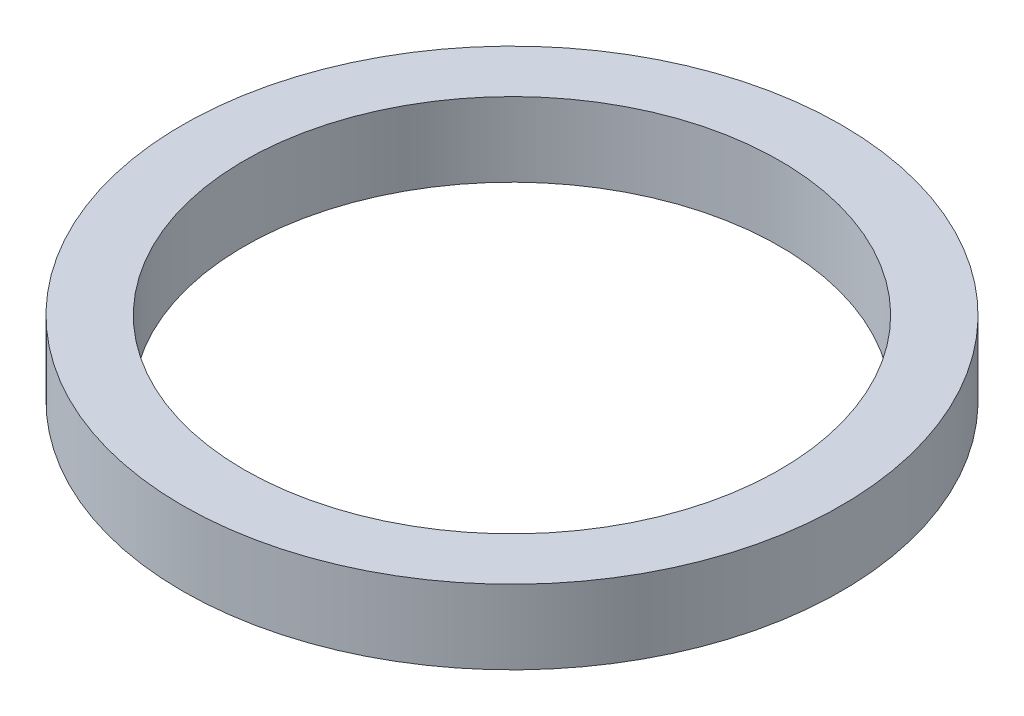
ISO-10303-21;
HEADER;
FILE_DESCRIPTION(('STEP AP214'),'2;1');
FILE_NAME('part.step','',(''),(''),'','','');
FILE_SCHEMA(('AUTOMOTIVE_DESIGN { 1 0 10303 214 1 1 1 1 }'));
ENDSEC;
DATA;
#1=APPLICATION_CONTEXT('core data for automotive mechanical design processes');
#2=APPLICATION_PROTOCOL_DEFINITION('international standard','automotive_design',2000,#1);
#3=PRODUCT_CONTEXT('',#1,'mechanical');
#4=PRODUCT('Part','Part','',(#3));
#5=PRODUCT_RELATED_PRODUCT_CATEGORY('part','',(#4));
#6=PRODUCT_DEFINITION_FORMATION('','',#4);
#7=PRODUCT_DEFINITION_CONTEXT('part definition',#1,'design');
#8=PRODUCT_DEFINITION('design','',#6,#7);
#9=PRODUCT_DEFINITION_SHAPE('','',#8);
#10=(LENGTH_UNIT() NAMED_UNIT(*) SI_UNIT(.MILLI.,.METRE.));
#11=(NAMED_UNIT(*) PLANE_ANGLE_UNIT() SI_UNIT($,.RADIAN.));
#12=(NAMED_UNIT(*) SI_UNIT($,.STERADIAN.) SOLID_ANGLE_UNIT());
#13=UNCERTAINTY_MEASURE_WITH_UNIT(LENGTH_MEASURE(1.E-05),#10,'distance_accuracy_value','');
#14=(GEOMETRIC_REPRESENTATION_CONTEXT(3) GLOBAL_UNCERTAINTY_ASSIGNED_CONTEXT((#13)) GLOBAL_UNIT_ASSIGNED_CONTEXT((#10,
#11,#12)) REPRESENTATION_CONTEXT('',''));
#15=CARTESIAN_POINT('',(0.,0.,0.));
#16=DIRECTION('',(0.,0.,1.));
#17=DIRECTION('',(1.,0.,0.));
#18=AXIS2_PLACEMENT_3D('',#15,#16,#17);
#19=CARTESIAN_POINT('',(0.,9.,0.));
#20=DIRECTION('',(0.,-1.,0.));
#21=DIRECTION('',(0.,0.,-1.));
#22=AXIS2_PLACEMENT_3D('',#19,#20,#21);
#23=CYLINDRICAL_SURFACE('',#22,40.);
#24=CARTESIAN_POINT('',(0.,9.,0.));
#25=DIRECTION('',(0.,1.,0.));
#26=DIRECTION('',(0.,0.,1.));
#27=AXIS2_PLACEMENT_3D('',#24,#25,#26);
#28=CIRCLE('',#27,40.);
#29=CARTESIAN_POINT('',(0.,9.,40.));
#30=VERTEX_POINT('',#29);
#31=EDGE_CURVE('E10',#30,#30,#28,.T.);
#32=ORIENTED_EDGE('',*,*,#31,.F.);
#33=EDGE_LOOP('',(#32));
#34=FACE_BOUND('',#33,.T.);
#35=CARTESIAN_POINT('',(0.,0.,0.));
#36=DIRECTION('',(0.,1.,0.));
#37=DIRECTION('',(0.,0.,1.));
#38=AXIS2_PLACEMENT_3D('',#35,#36,#37);
#39=CIRCLE('',#38,40.);
#40=CARTESIAN_POINT('',(0.,0.,40.));
#41=VERTEX_POINT('',#40);
#42=EDGE_CURVE('E37',#41,#41,#39,.T.);
#43=ORIENTED_EDGE('',*,*,#42,.T.);
#44=EDGE_LOOP('',(#43));
#45=FACE_BOUND('',#44,.T.);
#46=ADVANCED_FACE('F40',(#34,#45),#23,.T.);
#47=CARTESIAN_POINT('',(0.,9.,0.));
#48=DIRECTION('',(0.,1.,0.));
#49=DIRECTION('',(0.,0.,1.));
#50=AXIS2_PLACEMENT_3D('',#47,#48,#49);
#51=PLANE('',#50);
#52=CARTESIAN_POINT('',(0.,9.,0.));
#53=DIRECTION('',(0.,1.,0.));
#54=DIRECTION('',(0.,0.,1.));
#55=AXIS2_PLACEMENT_3D('',#52,#53,#54);
#56=CIRCLE('',#55,32.5);
#57=CARTESIAN_POINT('',(0.,9.,32.5));
#58=VERTEX_POINT('',#57);
#59=EDGE_CURVE('E50',#58,#58,#56,.T.);
#60=ORIENTED_EDGE('',*,*,#59,.F.);
#61=EDGE_LOOP('',(#60));
#62=FACE_BOUND('',#61,.T.);
#63=ORIENTED_EDGE('',*,*,#31,.T.);
#64=EDGE_LOOP('',(#63));
#65=FACE_BOUND('',#64,.T.);
#66=ADVANCED_FACE('F59',(#62,#65),#51,.T.);
#67=CARTESIAN_POINT('',(0.,0.,0.));
#68=DIRECTION('',(0.,1.,0.));
#69=DIRECTION('',(0.,0.,1.));
#70=AXIS2_PLACEMENT_3D('',#67,#68,#69);
#71=PLANE('',#70);
#72=CARTESIAN_POINT('',(0.,0.,0.));
#73=DIRECTION('',(0.,1.,0.));
#74=DIRECTION('',(0.,0.,1.));
#75=AXIS2_PLACEMENT_3D('',#72,#73,#74);
#76=CIRCLE('',#75,32.5);
#77=CARTESIAN_POINT('',(0.,0.,32.5));
#78=VERTEX_POINT('',#77);
#79=EDGE_CURVE('E47',#78,#78,#76,.T.);
#80=ORIENTED_EDGE('',*,*,#79,.T.);
#81=EDGE_LOOP('',(#80));
#82=FACE_BOUND('',#81,.T.);
#83=ORIENTED_EDGE('',*,*,#42,.F.);
#84=EDGE_LOOP('',(#83));
#85=FACE_BOUND('',#84,.T.);
#86=ADVANCED_FACE('F58',(#82,#85),#71,.F.);
#87=CARTESIAN_POINT('',(0.,9.,0.));
#88=DIRECTION('',(0.,-1.,0.));
#89=DIRECTION('',(0.,0.,-1.));
#90=AXIS2_PLACEMENT_3D('',#87,#88,#89);
#91=CYLINDRICAL_SURFACE('',#90,32.5);
#92=ORIENTED_EDGE('',*,*,#59,.T.);
#93=EDGE_LOOP('',(#92));
#94=FACE_BOUND('',#93,.T.);
#95=ORIENTED_EDGE('',*,*,#79,.F.);
#96=EDGE_LOOP('',(#95));
#97=FACE_BOUND('',#96,.T.);
#98=ADVANCED_FACE('F54',(#94,#97),#91,.F.);
#99=CLOSED_SHELL('',(#46,#66,#86,#98));
#100=MANIFOLD_SOLID_BREP('B2',#99);
#101=ADVANCED_BREP_SHAPE_REPRESENTATION('',(#18,#100),#14);
#102=SHAPE_DEFINITION_REPRESENTATION(#9,#101);
ENDSEC;
END-ISO-10303-21;
